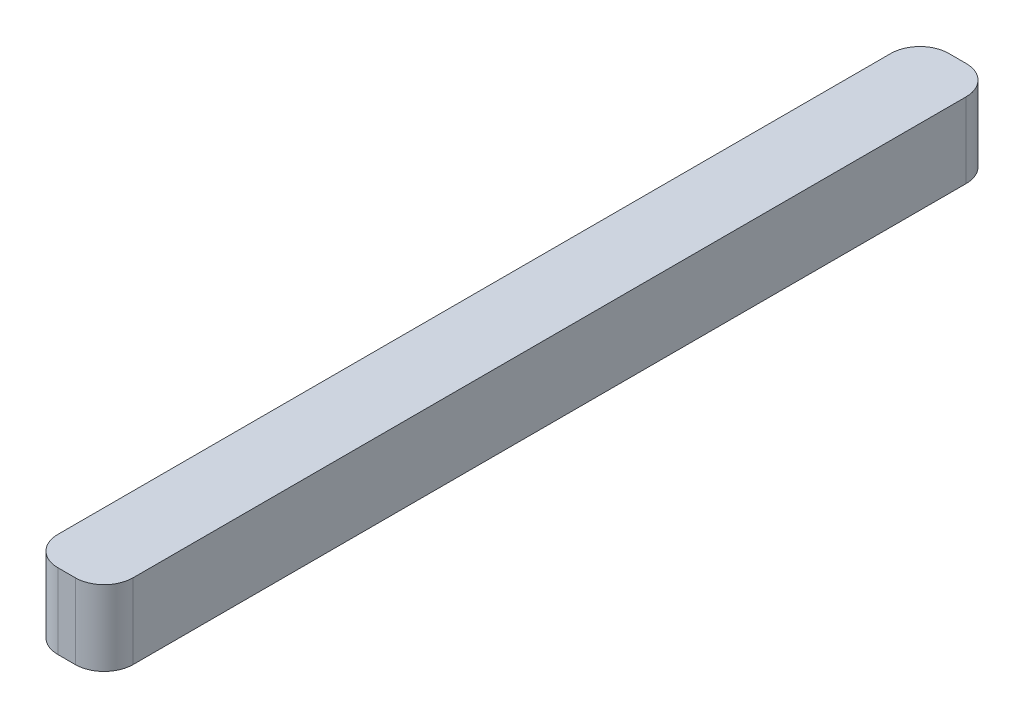
ISO-10303-21;
HEADER;
FILE_DESCRIPTION(('STEP AP214'),'2;1');
FILE_NAME('part.step','',(''),(''),'','','');
FILE_SCHEMA(('AUTOMOTIVE_DESIGN { 1 0 10303 214 1 1 1 1 }'));
ENDSEC;
DATA;
#1=APPLICATION_CONTEXT('core data for automotive mechanical design processes');
#2=APPLICATION_PROTOCOL_DEFINITION('international standard','automotive_design',2000,#1);
#3=PRODUCT_CONTEXT('',#1,'mechanical');
#4=PRODUCT('Part','Part','',(#3));
#5=PRODUCT_RELATED_PRODUCT_CATEGORY('part','',(#4));
#6=PRODUCT_DEFINITION_FORMATION('','',#4);
#7=PRODUCT_DEFINITION_CONTEXT('part definition',#1,'design');
#8=PRODUCT_DEFINITION('design','',#6,#7);
#9=PRODUCT_DEFINITION_SHAPE('','',#8);
#10=(LENGTH_UNIT() NAMED_UNIT(*) SI_UNIT(.MILLI.,.METRE.));
#11=(NAMED_UNIT(*) PLANE_ANGLE_UNIT() SI_UNIT($,.RADIAN.));
#12=(NAMED_UNIT(*) SI_UNIT($,.STERADIAN.) SOLID_ANGLE_UNIT());
#13=UNCERTAINTY_MEASURE_WITH_UNIT(LENGTH_MEASURE(1.E-05),#10,'distance_accuracy_value','');
#14=(GEOMETRIC_REPRESENTATION_CONTEXT(3) GLOBAL_UNCERTAINTY_ASSIGNED_CONTEXT((#13)) GLOBAL_UNIT_ASSIGNED_CONTEXT((#10,
#11,#12)) REPRESENTATION_CONTEXT('',''));
#15=CARTESIAN_POINT('',(0.,0.,0.));
#16=DIRECTION('',(0.,0.,1.));
#17=DIRECTION('',(1.,0.,0.));
#18=AXIS2_PLACEMENT_3D('',#15,#16,#17);
#19=CARTESIAN_POINT('',(-9.,-1.39999999999998,22.));
#20=DIRECTION('',(0.,-1.,0.));
#21=DIRECTION('',(1.,0.,0.));
#22=AXIS2_PLACEMENT_3D('',#19,#20,#21);
#23=CYLINDRICAL_SURFACE('',#22,0.999999999999999);
#24=CARTESIAN_POINT('',(-9.,-3.99999999999998,22.));
#25=DIRECTION('',(0.,-1.,0.));
#26=DIRECTION('',(1.,0.,0.));
#27=AXIS2_PLACEMENT_3D('',#24,#25,#26);
#28=CIRCLE('',#27,0.999999999999999);
#29=CARTESIAN_POINT('',(-10.,-3.99999999999998,22.));
#30=VERTEX_POINT('',#29);
#31=CARTESIAN_POINT('',(-9.,-3.99999999999998,23.));
#32=VERTEX_POINT('',#31);
#33=EDGE_CURVE('E95',#30,#32,#28,.F.);
#34=ORIENTED_EDGE('',*,*,#33,.T.);
#35=DIRECTION('',(0.,-1.,0.));
#36=VECTOR('',#35,1.);
#37=CARTESIAN_POINT('',(-9.,-2.69999999999998,23.));
#38=LINE('',#37,#36);
#39=CARTESIAN_POINT('',(-9.,-1.39999999999998,23.));
#40=VERTEX_POINT('',#39);
#41=EDGE_CURVE('E96',#40,#32,#38,.T.);
#42=ORIENTED_EDGE('',*,*,#41,.F.);
#43=CARTESIAN_POINT('',(-9.,-1.39999999999998,22.));
#44=DIRECTION('',(0.,-1.,0.));
#45=DIRECTION('',(1.,0.,0.));
#46=AXIS2_PLACEMENT_3D('',#43,#44,#45);
#47=CIRCLE('',#46,0.999999999999999);
#48=CARTESIAN_POINT('',(-10.,-1.39999999999998,22.));
#49=VERTEX_POINT('',#48);
#50=EDGE_CURVE('E20',#40,#49,#47,.T.);
#51=ORIENTED_EDGE('',*,*,#50,.T.);
#52=DIRECTION('',(0.,1.,0.));
#53=VECTOR('',#52,1.);
#54=CARTESIAN_POINT('',(-10.,-2.69999999999998,22.));
#55=LINE('',#54,#53);
#56=EDGE_CURVE('E79',#30,#49,#55,.T.);
#57=ORIENTED_EDGE('',*,*,#56,.F.);
#58=EDGE_LOOP('',(#34,#42,#51,#57));
#59=FACE_BOUND('',#58,.T.);
#60=ADVANCED_FACE('F16',(#59),#23,.T.);
#61=CARTESIAN_POINT('',(-9.01,-4.00999999999998,23.));
#62=DIRECTION('',(0.,0.,1.));
#63=DIRECTION('',(1.,0.,0.));
#64=AXIS2_PLACEMENT_3D('',#61,#62,#63);
#65=PLANE('',#64);
#66=ORIENTED_EDGE('',*,*,#41,.T.);
#67=DIRECTION('',(1.,0.,0.));
#68=VECTOR('',#67,1.);
#69=CARTESIAN_POINT('',(-8.7,-3.99999999999998,23.));
#70=LINE('',#69,#68);
#71=CARTESIAN_POINT('',(-8.4,-3.99999999999998,23.));
#72=VERTEX_POINT('',#71);
#73=EDGE_CURVE('E99',#32,#72,#70,.T.);
#74=ORIENTED_EDGE('',*,*,#73,.T.);
#75=DIRECTION('',(0.,-1.,0.));
#76=VECTOR('',#75,1.);
#77=CARTESIAN_POINT('',(-8.4,-2.69999999999998,23.));
#78=LINE('',#77,#76);
#79=CARTESIAN_POINT('',(-8.4,-1.39999999999998,23.));
#80=VERTEX_POINT('',#79);
#81=EDGE_CURVE('E114',#80,#72,#78,.T.);
#82=ORIENTED_EDGE('',*,*,#81,.F.);
#83=DIRECTION('',(1.,0.,0.));
#84=VECTOR('',#83,1.);
#85=CARTESIAN_POINT('',(-8.7,-1.39999999999998,23.));
#86=LINE('',#85,#84);
#87=EDGE_CURVE('E83',#40,#80,#86,.T.);
#88=ORIENTED_EDGE('',*,*,#87,.F.);
#89=EDGE_LOOP('',(#66,#74,#82,#88));
#90=FACE_BOUND('',#89,.T.);
#91=ADVANCED_FACE('F226',(#90),#65,.T.);
#92=CARTESIAN_POINT('',(-10.,-4.00999999999998,-6.81));
#93=DIRECTION('',(-1.,0.,0.));
#94=DIRECTION('',(0.,0.,1.));
#95=AXIS2_PLACEMENT_3D('',#92,#93,#94);
#96=PLANE('',#95);
#97=ORIENTED_EDGE('',*,*,#56,.T.);
#98=DIRECTION('',(0.,0.,1.));
#99=VECTOR('',#98,1.);
#100=CARTESIAN_POINT('',(-10.,-1.39999999999998,7.6));
#101=LINE('',#100,#99);
#102=CARTESIAN_POINT('',(-10.,-1.39999999999998,-6.8));
#103=VERTEX_POINT('',#102);
#104=EDGE_CURVE('E81',#103,#49,#101,.T.);
#105=ORIENTED_EDGE('',*,*,#104,.F.);
#106=DIRECTION('',(0.,1.,0.));
#107=VECTOR('',#106,1.);
#108=CARTESIAN_POINT('',(-10.,-2.69999999999998,-6.8));
#109=LINE('',#108,#107);
#110=CARTESIAN_POINT('',(-10.,-3.99999999999998,-6.8));
#111=VERTEX_POINT('',#110);
#112=EDGE_CURVE('E66',#111,#103,#109,.T.);
#113=ORIENTED_EDGE('',*,*,#112,.F.);
#114=DIRECTION('',(0.,0.,-1.));
#115=VECTOR('',#114,1.);
#116=CARTESIAN_POINT('',(-10.,-3.99999999999998,7.6));
#117=LINE('',#116,#115);
#118=EDGE_CURVE('E109',#30,#111,#117,.T.);
#119=ORIENTED_EDGE('',*,*,#118,.F.);
#120=EDGE_LOOP('',(#97,#105,#113,#119));
#121=FACE_BOUND('',#120,.T.);
#122=ADVANCED_FACE('F82',(#121),#96,.T.);
#123=CARTESIAN_POINT('',(-9.,-3.99999999999998,-6.8));
#124=DIRECTION('',(0.,1.,0.));
#125=DIRECTION('',(0.,0.,1.));
#126=AXIS2_PLACEMENT_3D('',#123,#124,#125);
#127=CYLINDRICAL_SURFACE('',#126,0.999999999999999);
#128=CARTESIAN_POINT('',(-9.,-1.39999999999998,-6.8));
#129=DIRECTION('',(0.,1.,0.));
#130=DIRECTION('',(0.,0.,1.));
#131=AXIS2_PLACEMENT_3D('',#128,#129,#130);
#132=CIRCLE('',#131,0.999999999999999);
#133=CARTESIAN_POINT('',(-9.,-1.39999999999998,-7.8));
#134=VERTEX_POINT('',#133);
#135=EDGE_CURVE('E72',#134,#103,#132,.T.);
#136=ORIENTED_EDGE('',*,*,#135,.F.);
#137=DIRECTION('',(0.,1.,0.));
#138=VECTOR('',#137,1.);
#139=CARTESIAN_POINT('',(-9.,-2.69999999999998,-7.8));
#140=LINE('',#139,#138);
#141=CARTESIAN_POINT('',(-9.,-3.99999999999998,-7.8));
#142=VERTEX_POINT('',#141);
#143=EDGE_CURVE('E130',#142,#134,#140,.T.);
#144=ORIENTED_EDGE('',*,*,#143,.F.);
#145=CARTESIAN_POINT('',(-9.,-3.99999999999998,-6.8));
#146=DIRECTION('',(0.,1.,0.));
#147=DIRECTION('',(0.,0.,1.));
#148=AXIS2_PLACEMENT_3D('',#145,#146,#147);
#149=CIRCLE('',#148,0.999999999999999);
#150=EDGE_CURVE('E75',#111,#142,#149,.F.);
#151=ORIENTED_EDGE('',*,*,#150,.F.);
#152=ORIENTED_EDGE('',*,*,#112,.T.);
#153=EDGE_LOOP('',(#136,#144,#151,#152));
#154=FACE_BOUND('',#153,.T.);
#155=ADVANCED_FACE('F68',(#154),#127,.T.);
#156=CARTESIAN_POINT('',(-10.01,-1.39999999999998,-7.81));
#157=DIRECTION('',(0.,1.,0.));
#158=DIRECTION('',(0.,0.,1.));
#159=AXIS2_PLACEMENT_3D('',#156,#157,#158);
#160=PLANE('',#159);
#161=CARTESIAN_POINT('',(-8.4,-1.39999999999998,22.));
#162=DIRECTION('',(0.,-1.,0.));
#163=DIRECTION('',(0.,0.,-1.));
#164=AXIS2_PLACEMENT_3D('',#161,#162,#163);
#165=CIRCLE('',#164,1.);
#166=CARTESIAN_POINT('',(-7.4,-1.39999999999998,22.));
#167=VERTEX_POINT('',#166);
#168=EDGE_CURVE('E93',#167,#80,#165,.T.);
#169=ORIENTED_EDGE('',*,*,#168,.F.);
#170=DIRECTION('',(0.,0.,1.));
#171=VECTOR('',#170,1.);
#172=CARTESIAN_POINT('',(-7.4,-1.39999999999998,7.6));
#173=LINE('',#172,#171);
#174=CARTESIAN_POINT('',(-7.4,-1.39999999999998,-6.8));
#175=VERTEX_POINT('',#174);
#176=EDGE_CURVE('E134',#175,#167,#173,.T.);
#177=ORIENTED_EDGE('',*,*,#176,.F.);
#178=CARTESIAN_POINT('',(-8.4,-1.39999999999998,-6.8));
#179=DIRECTION('',(0.,1.,0.));
#180=DIRECTION('',(0.,0.,1.));
#181=AXIS2_PLACEMENT_3D('',#178,#179,#180);
#182=CIRCLE('',#181,1.);
#183=CARTESIAN_POINT('',(-8.4,-1.39999999999998,-7.8));
#184=VERTEX_POINT('',#183);
#185=EDGE_CURVE('E34',#175,#184,#182,.T.);
#186=ORIENTED_EDGE('',*,*,#185,.T.);
#187=DIRECTION('',(1.,0.,0.));
#188=VECTOR('',#187,1.);
#189=CARTESIAN_POINT('',(-8.7,-1.39999999999998,-7.8));
#190=LINE('',#189,#188);
#191=EDGE_CURVE('E88',#134,#184,#190,.T.);
#192=ORIENTED_EDGE('',*,*,#191,.F.);
#193=ORIENTED_EDGE('',*,*,#135,.T.);
#194=ORIENTED_EDGE('',*,*,#104,.T.);
#195=ORIENTED_EDGE('',*,*,#50,.F.);
#196=ORIENTED_EDGE('',*,*,#87,.T.);
#197=EDGE_LOOP('',(#169,#177,#186,#192,#193,#194,#195,#196));
#198=FACE_BOUND('',#197,.T.);
#199=ADVANCED_FACE('F86',(#198),#160,.T.);
#200=CARTESIAN_POINT('',(-8.4,-1.39999999999998,22.));
#201=DIRECTION('',(0.,-1.,0.));
#202=DIRECTION('',(0.,0.,-1.));
#203=AXIS2_PLACEMENT_3D('',#200,#201,#202);
#204=CYLINDRICAL_SURFACE('',#203,1.);
#205=CARTESIAN_POINT('',(-8.4,-3.99999999999998,22.));
#206=DIRECTION('',(0.,-1.,0.));
#207=DIRECTION('',(0.,0.,-1.));
#208=AXIS2_PLACEMENT_3D('',#205,#206,#207);
#209=CIRCLE('',#208,1.);
#210=CARTESIAN_POINT('',(-7.4,-3.99999999999998,22.));
#211=VERTEX_POINT('',#210);
#212=EDGE_CURVE('E110',#211,#72,#209,.T.);
#213=ORIENTED_EDGE('',*,*,#212,.F.);
#214=DIRECTION('',(0.,-1.,0.));
#215=VECTOR('',#214,1.);
#216=CARTESIAN_POINT('',(-7.4,-2.69999999999998,22.));
#217=LINE('',#216,#215);
#218=EDGE_CURVE('E138',#167,#211,#217,.T.);
#219=ORIENTED_EDGE('',*,*,#218,.F.);
#220=ORIENTED_EDGE('',*,*,#168,.T.);
#221=ORIENTED_EDGE('',*,*,#81,.T.);
#222=EDGE_LOOP('',(#213,#219,#220,#221));
#223=FACE_BOUND('',#222,.T.);
#224=ADVANCED_FACE('F156',(#223),#204,.T.);
#225=CARTESIAN_POINT('',(-7.39,-3.99999999999998,23.01));
#226=DIRECTION('',(0.,-1.,0.));
#227=DIRECTION('',(-1.,0.,0.));
#228=AXIS2_PLACEMENT_3D('',#225,#226,#227);
#229=PLANE('',#228);
#230=ORIENTED_EDGE('',*,*,#150,.T.);
#231=DIRECTION('',(-1.,0.,0.));
#232=VECTOR('',#231,1.);
#233=CARTESIAN_POINT('',(-8.7,-3.99999999999998,-7.8));
#234=LINE('',#233,#232);
#235=CARTESIAN_POINT('',(-8.4,-3.99999999999998,-7.8));
#236=VERTEX_POINT('',#235);
#237=EDGE_CURVE('E108',#236,#142,#234,.T.);
#238=ORIENTED_EDGE('',*,*,#237,.F.);
#239=CARTESIAN_POINT('',(-8.4,-3.99999999999998,-6.8));
#240=DIRECTION('',(0.,1.,0.));
#241=DIRECTION('',(0.,0.,1.));
#242=AXIS2_PLACEMENT_3D('',#239,#240,#241);
#243=CIRCLE('',#242,1.);
#244=CARTESIAN_POINT('',(-7.4,-3.99999999999998,-6.8));
#245=VERTEX_POINT('',#244);
#246=EDGE_CURVE('E112',#236,#245,#243,.F.);
#247=ORIENTED_EDGE('',*,*,#246,.T.);
#248=DIRECTION('',(0.,0.,-1.));
#249=VECTOR('',#248,1.);
#250=CARTESIAN_POINT('',(-7.4,-3.99999999999998,7.6));
#251=LINE('',#250,#249);
#252=EDGE_CURVE('E132',#211,#245,#251,.T.);
#253=ORIENTED_EDGE('',*,*,#252,.F.);
#254=ORIENTED_EDGE('',*,*,#212,.T.);
#255=ORIENTED_EDGE('',*,*,#73,.F.);
#256=ORIENTED_EDGE('',*,*,#33,.F.);
#257=ORIENTED_EDGE('',*,*,#118,.T.);
#258=EDGE_LOOP('',(#230,#238,#247,#253,#254,#255,#256,#257));
#259=FACE_BOUND('',#258,.T.);
#260=ADVANCED_FACE('F143',(#259),#229,.T.);
#261=CARTESIAN_POINT('',(-8.39,-4.00999999999998,-7.8));
#262=DIRECTION('',(0.,0.,-1.));
#263=DIRECTION('',(-1.,0.,0.));
#264=AXIS2_PLACEMENT_3D('',#261,#262,#263);
#265=PLANE('',#264);
#266=ORIENTED_EDGE('',*,*,#143,.T.);
#267=ORIENTED_EDGE('',*,*,#191,.T.);
#268=DIRECTION('',(0.,1.,0.));
#269=VECTOR('',#268,1.);
#270=CARTESIAN_POINT('',(-8.4,-2.69999999999998,-7.8));
#271=LINE('',#270,#269);
#272=EDGE_CURVE('E26',#236,#184,#271,.T.);
#273=ORIENTED_EDGE('',*,*,#272,.F.);
#274=ORIENTED_EDGE('',*,*,#237,.T.);
#275=EDGE_LOOP('',(#266,#267,#273,#274));
#276=FACE_BOUND('',#275,.T.);
#277=ADVANCED_FACE('F161',(#276),#265,.T.);
#278=CARTESIAN_POINT('',(-7.4,-4.00999999999998,22.01));
#279=DIRECTION('',(1.,0.,0.));
#280=DIRECTION('',(0.,0.,-1.));
#281=AXIS2_PLACEMENT_3D('',#278,#279,#280);
#282=PLANE('',#281);
#283=ORIENTED_EDGE('',*,*,#218,.T.);
#284=ORIENTED_EDGE('',*,*,#252,.T.);
#285=DIRECTION('',(0.,-1.,0.));
#286=VECTOR('',#285,1.);
#287=CARTESIAN_POINT('',(-7.4,-2.69999999999998,-6.8));
#288=LINE('',#287,#286);
#289=EDGE_CURVE('E11',#175,#245,#288,.T.);
#290=ORIENTED_EDGE('',*,*,#289,.F.);
#291=ORIENTED_EDGE('',*,*,#176,.T.);
#292=EDGE_LOOP('',(#283,#284,#290,#291));
#293=FACE_BOUND('',#292,.T.);
#294=ADVANCED_FACE('F158',(#293),#282,.T.);
#295=CARTESIAN_POINT('',(-8.4,-3.99999999999998,-6.8));
#296=DIRECTION('',(0.,1.,0.));
#297=DIRECTION('',(0.,0.,1.));
#298=AXIS2_PLACEMENT_3D('',#295,#296,#297);
#299=CYLINDRICAL_SURFACE('',#298,1.);
#300=ORIENTED_EDGE('',*,*,#185,.F.);
#301=ORIENTED_EDGE('',*,*,#289,.T.);
#302=ORIENTED_EDGE('',*,*,#246,.F.);
#303=ORIENTED_EDGE('',*,*,#272,.T.);
#304=EDGE_LOOP('',(#300,#301,#302,#303));
#305=FACE_BOUND('',#304,.T.);
#306=ADVANCED_FACE('F18',(#305),#299,.T.);
#307=CLOSED_SHELL('',(#60,#91,#122,#155,#199,#224,#260,#277,#294,#306));
#308=MANIFOLD_SOLID_BREP('B1',#307);
#309=ADVANCED_BREP_SHAPE_REPRESENTATION('',(#18,#308),#14);
#310=SHAPE_DEFINITION_REPRESENTATION(#9,#309);
ENDSEC;
END-ISO-10303-21;
